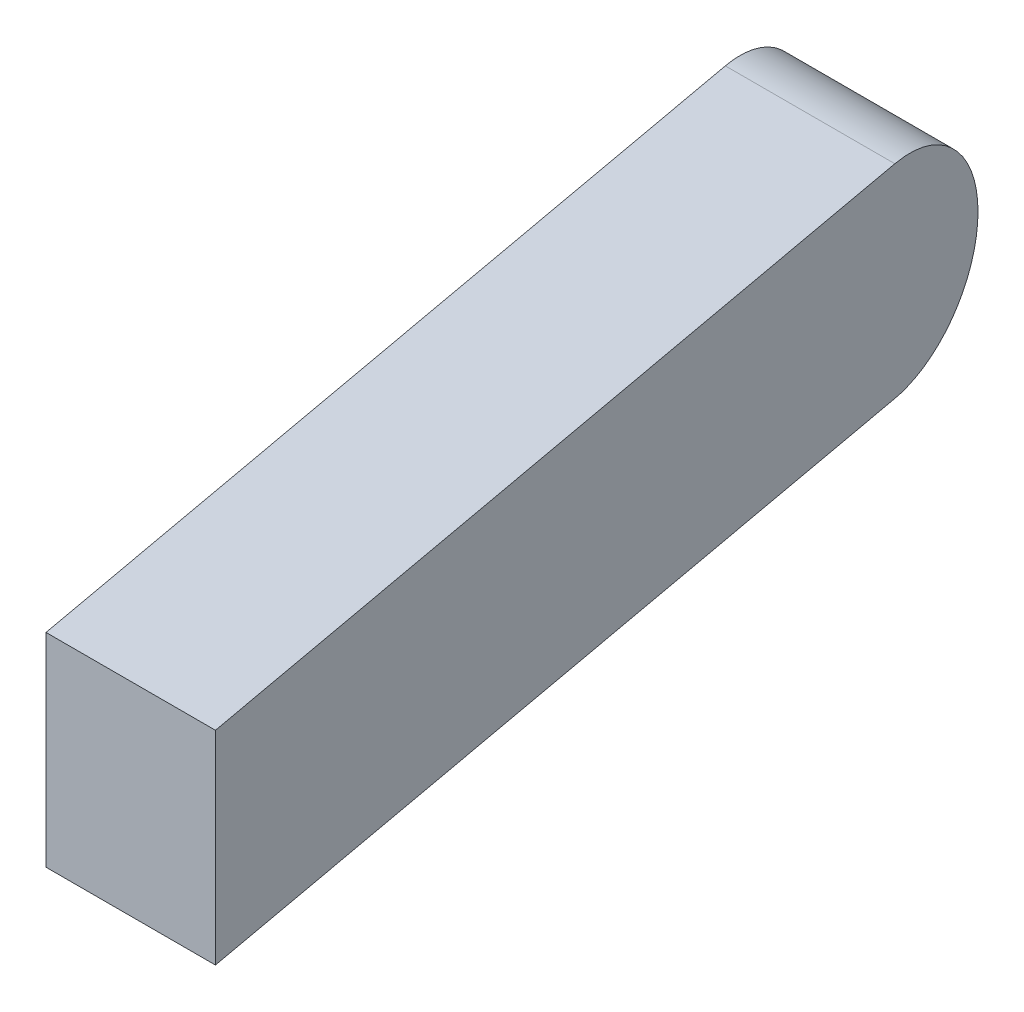
ISO-10303-21;
HEADER;
FILE_DESCRIPTION(('STEP AP214'),'2;1');
FILE_NAME('part.step','',(''),(''),'','','');
FILE_SCHEMA(('AUTOMOTIVE_DESIGN { 1 0 10303 214 1 1 1 1 }'));
ENDSEC;
DATA;
#1=APPLICATION_CONTEXT('core data for automotive mechanical design processes');
#2=APPLICATION_PROTOCOL_DEFINITION('international standard','automotive_design',2000,#1);
#3=PRODUCT_CONTEXT('',#1,'mechanical');
#4=PRODUCT('Part','Part','',(#3));
#5=PRODUCT_RELATED_PRODUCT_CATEGORY('part','',(#4));
#6=PRODUCT_DEFINITION_FORMATION('','',#4);
#7=PRODUCT_DEFINITION_CONTEXT('part definition',#1,'design');
#8=PRODUCT_DEFINITION('design','',#6,#7);
#9=PRODUCT_DEFINITION_SHAPE('','',#8);
#10=(LENGTH_UNIT() NAMED_UNIT(*) SI_UNIT(.MILLI.,.METRE.));
#11=(NAMED_UNIT(*) PLANE_ANGLE_UNIT() SI_UNIT($,.RADIAN.));
#12=(NAMED_UNIT(*) SI_UNIT($,.STERADIAN.) SOLID_ANGLE_UNIT());
#13=UNCERTAINTY_MEASURE_WITH_UNIT(LENGTH_MEASURE(1.E-05),#10,'distance_accuracy_value','');
#14=(GEOMETRIC_REPRESENTATION_CONTEXT(3) GLOBAL_UNCERTAINTY_ASSIGNED_CONTEXT((#13)) GLOBAL_UNIT_ASSIGNED_CONTEXT((#10,
#11,#12)) REPRESENTATION_CONTEXT('',''));
#15=CARTESIAN_POINT('',(0.,0.,0.));
#16=DIRECTION('',(0.,0.,1.));
#17=DIRECTION('',(1.,0.,0.));
#18=AXIS2_PLACEMENT_3D('',#15,#16,#17);
#19=CARTESIAN_POINT('',(-1.,0.6,-5.5));
#20=DIRECTION('',(0.983869910099908,0.,-0.178885438199983));
#21=DIRECTION('',(-0.178885438199983,0.,-0.983869910099908));
#22=AXIS2_PLACEMENT_3D('',#19,#20,#21);
#23=PLANE('',#22);
#24=DIRECTION('',(0.178885438199983,0.,0.983869910099908));
#25=VECTOR('',#24,1.);
#26=CARTESIAN_POINT('',(-1.,0.6,-5.5));
#27=LINE('',#26,#25);
#28=CARTESIAN_POINT('',(-0.890909090909091,0.6,-4.9));
#29=VERTEX_POINT('',#28);
#30=CARTESIAN_POINT('',(0.,0.6,0.));
#31=VERTEX_POINT('',#30);
#32=EDGE_CURVE('E97',#29,#31,#27,.T.);
#33=ORIENTED_EDGE('',*,*,#32,.F.);
#34=CARTESIAN_POINT('',(-0.890909090909091,0.,-4.9));
#35=DIRECTION('',(0.983869910099908,0.,-0.178885438199983));
#36=DIRECTION('',(0.178885438199983,0.,0.983869910099908));
#37=AXIS2_PLACEMENT_3D('',#34,#35,#36);
#38=ELLIPSE('',#37,0.609836721136306,0.6);
#39=CARTESIAN_POINT('',(-0.890909090909091,-0.6,-4.9));
#40=VERTEX_POINT('',#39);
#41=EDGE_CURVE('E109',#29,#40,#38,.F.);
#42=ORIENTED_EDGE('',*,*,#41,.T.);
#43=DIRECTION('',(0.178885438199983,0.,0.983869910099908));
#44=VECTOR('',#43,1.);
#45=CARTESIAN_POINT('',(-1.,-0.6,-5.5));
#46=LINE('',#45,#44);
#47=CARTESIAN_POINT('',(0.,-0.6,0.));
#48=VERTEX_POINT('',#47);
#49=EDGE_CURVE('E87',#40,#48,#46,.T.);
#50=ORIENTED_EDGE('',*,*,#49,.T.);
#51=DIRECTION('',(0.,-1.,0.));
#52=VECTOR('',#51,1.);
#53=CARTESIAN_POINT('',(0.,0.6,0.));
#54=LINE('',#53,#52);
#55=EDGE_CURVE('E81',#31,#48,#54,.T.);
#56=ORIENTED_EDGE('',*,*,#55,.F.);
#57=EDGE_LOOP('',(#33,#42,#50,#56));
#58=FACE_BOUND('',#57,.T.);
#59=ADVANCED_FACE('F39',(#58),#23,.F.);
#60=CARTESIAN_POINT('',(1.,0.6,0.));
#61=DIRECTION('',(-0.983869910099908,0.,0.178885438199983));
#62=DIRECTION('',(0.178885438199983,0.,0.983869910099908));
#63=AXIS2_PLACEMENT_3D('',#60,#61,#62);
#64=PLANE('',#63);
#65=CARTESIAN_POINT('',(0.109090909090909,0.,-4.9));
#66=DIRECTION('',(-0.983869910099908,0.,0.178885438199983));
#67=DIRECTION('',(0.178885438199983,0.,0.983869910099908));
#68=AXIS2_PLACEMENT_3D('',#65,#66,#67);
#69=ELLIPSE('',#68,0.609836721136306,0.6);
#70=CARTESIAN_POINT('',(0.109090909090909,-0.6,-4.9));
#71=VERTEX_POINT('',#70);
#72=CARTESIAN_POINT('',(0.109090909090909,0.6,-4.9));
#73=VERTEX_POINT('',#72);
#74=EDGE_CURVE('E53',#71,#73,#69,.F.);
#75=ORIENTED_EDGE('',*,*,#74,.T.);
#76=DIRECTION('',(-0.178885438199983,0.,-0.983869910099908));
#77=VECTOR('',#76,1.);
#78=CARTESIAN_POINT('',(1.,0.6,0.));
#79=LINE('',#78,#77);
#80=CARTESIAN_POINT('',(1.,0.6,0.));
#81=VERTEX_POINT('',#80);
#82=EDGE_CURVE('E92',#81,#73,#79,.T.);
#83=ORIENTED_EDGE('',*,*,#82,.F.);
#84=DIRECTION('',(0.,-1.,0.));
#85=VECTOR('',#84,1.);
#86=CARTESIAN_POINT('',(1.,0.6,0.));
#87=LINE('',#86,#85);
#88=CARTESIAN_POINT('',(1.,-0.6,0.));
#89=VERTEX_POINT('',#88);
#90=EDGE_CURVE('E78',#81,#89,#87,.T.);
#91=ORIENTED_EDGE('',*,*,#90,.T.);
#92=DIRECTION('',(-0.178885438199983,0.,-0.983869910099908));
#93=VECTOR('',#92,1.);
#94=CARTESIAN_POINT('',(1.,-0.6,0.));
#95=LINE('',#94,#93);
#96=EDGE_CURVE('E86',#89,#71,#95,.T.);
#97=ORIENTED_EDGE('',*,*,#96,.T.);
#98=EDGE_LOOP('',(#75,#83,#91,#97));
#99=FACE_BOUND('',#98,.T.);
#100=ADVANCED_FACE('F91',(#99),#64,.F.);
#101=CARTESIAN_POINT('',(0.,-0.6,0.));
#102=DIRECTION('',(0.,1.,0.));
#103=DIRECTION('',(0.,0.,1.));
#104=AXIS2_PLACEMENT_3D('',#101,#102,#103);
#105=PLANE('',#104);
#106=DIRECTION('',(1.,0.,0.));
#107=VECTOR('',#106,1.);
#108=CARTESIAN_POINT('',(-1.,-0.6,-4.9));
#109=LINE('',#108,#107);
#110=EDGE_CURVE('E47',#71,#40,#109,.F.);
#111=ORIENTED_EDGE('',*,*,#110,.F.);
#112=ORIENTED_EDGE('',*,*,#96,.F.);
#113=DIRECTION('',(1.,0.,0.));
#114=VECTOR('',#113,1.);
#115=CARTESIAN_POINT('',(0.,-0.6,0.));
#116=LINE('',#115,#114);
#117=EDGE_CURVE('E75',#48,#89,#116,.T.);
#118=ORIENTED_EDGE('',*,*,#117,.F.);
#119=ORIENTED_EDGE('',*,*,#49,.F.);
#120=EDGE_LOOP('',(#111,#112,#118,#119));
#121=FACE_BOUND('',#120,.T.);
#122=ADVANCED_FACE('F95',(#121),#105,.F.);
#123=CARTESIAN_POINT('',(0.,0.6,0.));
#124=DIRECTION('',(0.,0.,-1.));
#125=DIRECTION('',(-1.,0.,0.));
#126=AXIS2_PLACEMENT_3D('',#123,#124,#125);
#127=PLANE('',#126);
#128=ORIENTED_EDGE('',*,*,#117,.T.);
#129=ORIENTED_EDGE('',*,*,#90,.F.);
#130=DIRECTION('',(1.,0.,0.));
#131=VECTOR('',#130,1.);
#132=CARTESIAN_POINT('',(0.,0.6,0.));
#133=LINE('',#132,#131);
#134=EDGE_CURVE('E62',#31,#81,#133,.T.);
#135=ORIENTED_EDGE('',*,*,#134,.F.);
#136=ORIENTED_EDGE('',*,*,#55,.T.);
#137=EDGE_LOOP('',(#128,#129,#135,#136));
#138=FACE_BOUND('',#137,.T.);
#139=ADVANCED_FACE('F77',(#138),#127,.F.);
#140=CARTESIAN_POINT('',(0.,0.6,0.));
#141=DIRECTION('',(0.,1.,0.));
#142=DIRECTION('',(0.,0.,1.));
#143=AXIS2_PLACEMENT_3D('',#140,#141,#142);
#144=PLANE('',#143);
#145=DIRECTION('',(1.,0.,0.));
#146=VECTOR('',#145,1.);
#147=CARTESIAN_POINT('',(-1.,0.6,-4.9));
#148=LINE('',#147,#146);
#149=EDGE_CURVE('E11',#29,#73,#148,.T.);
#150=ORIENTED_EDGE('',*,*,#149,.F.);
#151=ORIENTED_EDGE('',*,*,#32,.T.);
#152=ORIENTED_EDGE('',*,*,#134,.T.);
#153=ORIENTED_EDGE('',*,*,#82,.T.);
#154=EDGE_LOOP('',(#150,#151,#152,#153));
#155=FACE_BOUND('',#154,.T.);
#156=ADVANCED_FACE('F124',(#155),#144,.T.);
#157=CARTESIAN_POINT('',(-1.,0.,-4.9));
#158=DIRECTION('',(1.,0.,0.));
#159=DIRECTION('',(0.,0.,-1.));
#160=AXIS2_PLACEMENT_3D('',#157,#158,#159);
#161=CYLINDRICAL_SURFACE('',#160,0.6);
#162=ORIENTED_EDGE('',*,*,#41,.F.);
#163=ORIENTED_EDGE('',*,*,#149,.T.);
#164=ORIENTED_EDGE('',*,*,#74,.F.);
#165=ORIENTED_EDGE('',*,*,#110,.T.);
#166=EDGE_LOOP('',(#162,#163,#164,#165));
#167=FACE_BOUND('',#166,.T.);
#168=ADVANCED_FACE('F107',(#167),#161,.T.);
#169=CLOSED_SHELL('',(#59,#100,#122,#139,#156,#168));
#170=MANIFOLD_SOLID_BREP('B2',#169);
#171=ADVANCED_BREP_SHAPE_REPRESENTATION('',(#18,#170),#14);
#172=SHAPE_DEFINITION_REPRESENTATION(#9,#171);
ENDSEC;
END-ISO-10303-21;
